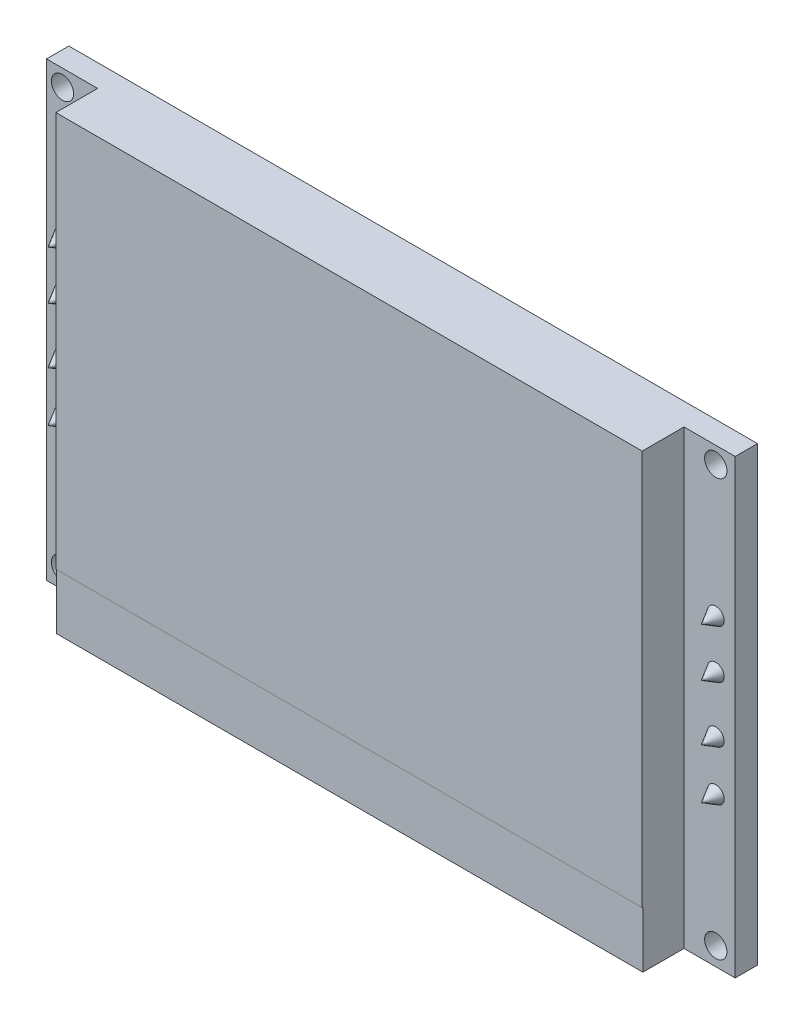
ISO-10303-21;
HEADER;
FILE_DESCRIPTION(('STEP AP214'),'2;1');
FILE_NAME('part.step','',(''),(''),'','','');
FILE_SCHEMA(('AUTOMOTIVE_DESIGN { 1 0 10303 214 1 1 1 1 }'));
ENDSEC;
DATA;
#1=APPLICATION_CONTEXT('core data for automotive mechanical design processes');
#2=APPLICATION_PROTOCOL_DEFINITION('international standard','automotive_design',2000,#1);
#3=PRODUCT_CONTEXT('',#1,'mechanical');
#4=PRODUCT('Part','Part','',(#3));
#5=PRODUCT_RELATED_PRODUCT_CATEGORY('part','',(#4));
#6=PRODUCT_DEFINITION_FORMATION('','',#4);
#7=PRODUCT_DEFINITION_CONTEXT('part definition',#1,'design');
#8=PRODUCT_DEFINITION('design','',#6,#7);
#9=PRODUCT_DEFINITION_SHAPE('','',#8);
#10=(LENGTH_UNIT() NAMED_UNIT(*) SI_UNIT(.MILLI.,.METRE.));
#11=(NAMED_UNIT(*) PLANE_ANGLE_UNIT() SI_UNIT($,.RADIAN.));
#12=(NAMED_UNIT(*) SI_UNIT($,.STERADIAN.) SOLID_ANGLE_UNIT());
#13=UNCERTAINTY_MEASURE_WITH_UNIT(LENGTH_MEASURE(1.E-05),#10,'distance_accuracy_value','');
#14=(GEOMETRIC_REPRESENTATION_CONTEXT(3) GLOBAL_UNCERTAINTY_ASSIGNED_CONTEXT((#13)) GLOBAL_UNIT_ASSIGNED_CONTEXT((#10,
#11,#12)) REPRESENTATION_CONTEXT('',''));
#15=CARTESIAN_POINT('',(0.,0.,0.));
#16=DIRECTION('',(0.,0.,1.));
#17=DIRECTION('',(1.,0.,0.));
#18=AXIS2_PLACEMENT_3D('',#15,#16,#17);
#19=CARTESIAN_POINT('',(0.,0.,1.6));
#20=DIRECTION('',(0.,0.,-1.));
#21=DIRECTION('',(-1.,0.,0.));
#22=AXIS2_PLACEMENT_3D('',#19,#20,#21);
#23=PLANE('',#22);
#24=CARTESIAN_POINT('',(48.0081893313298,18.3157101577395,1.6));
#25=DIRECTION('',(0.,0.,-1.));
#26=DIRECTION('',(-1.,0.,0.));
#27=AXIS2_PLACEMENT_3D('',#24,#25,#26);
#28=CIRCLE('',#27,0.6);
#29=CARTESIAN_POINT('',(47.4081893313298,18.3157101577395,1.6));
#30=VERTEX_POINT('',#29);
#31=EDGE_CURVE('E41',#30,#30,#28,.F.);
#32=ORIENTED_EDGE('',*,*,#31,.F.);
#33=EDGE_LOOP('',(#32));
#34=FACE_BOUND('',#33,.T.);
#35=CARTESIAN_POINT('',(48.0081893313298,21.8037691178312,1.6));
#36=DIRECTION('',(0.,0.,-1.));
#37=DIRECTION('',(-1.,0.,0.));
#38=AXIS2_PLACEMENT_3D('',#35,#36,#37);
#39=CIRCLE('',#38,0.6);
#40=CARTESIAN_POINT('',(47.4081893313298,21.8037691178312,1.6));
#41=VERTEX_POINT('',#40);
#42=EDGE_CURVE('E340',#41,#41,#39,.F.);
#43=ORIENTED_EDGE('',*,*,#42,.F.);
#44=EDGE_LOOP('',(#43));
#45=FACE_BOUND('',#44,.T.);
#46=CARTESIAN_POINT('',(48.0081893313298,31.2037691178312,1.6));
#47=DIRECTION('',(0.,0.,1.));
#48=DIRECTION('',(1.,0.,0.));
#49=AXIS2_PLACEMENT_3D('',#46,#47,#48);
#50=CIRCLE('',#49,0.800000000000002);
#51=CARTESIAN_POINT('',(48.8081893313298,31.2037691178312,1.6));
#52=VERTEX_POINT('',#51);
#53=EDGE_CURVE('E255',#52,#52,#50,.T.);
#54=ORIENTED_EDGE('',*,*,#53,.F.);
#55=EDGE_LOOP('',(#54));
#56=FACE_BOUND('',#55,.T.);
#57=CARTESIAN_POINT('',(48.0081893313298,1.31386177998997,1.6));
#58=DIRECTION('',(0.,0.,1.));
#59=DIRECTION('',(1.,0.,0.));
#60=AXIS2_PLACEMENT_3D('',#57,#58,#59);
#61=CIRCLE('',#60,0.800000000000003);
#62=CARTESIAN_POINT('',(48.8081893313298,1.31386177998997,1.6));
#63=VERTEX_POINT('',#62);
#64=EDGE_CURVE('E251',#63,#63,#61,.T.);
#65=ORIENTED_EDGE('',*,*,#64,.F.);
#66=EDGE_LOOP('',(#65));
#67=FACE_BOUND('',#66,.T.);
#68=DIRECTION('',(0.,1.,0.));
#69=VECTOR('',#68,1.);
#70=CARTESIAN_POINT('',(45.73,32.4,1.6));
#71=LINE('',#70,#69);
#72=CARTESIAN_POINT('',(45.73,0.,1.6));
#73=VERTEX_POINT('',#72);
#74=CARTESIAN_POINT('',(45.73,32.4,1.6));
#75=VERTEX_POINT('',#74);
#76=EDGE_CURVE('E209',#73,#75,#71,.T.);
#77=ORIENTED_EDGE('',*,*,#76,.F.);
#78=DIRECTION('',(1.,0.,0.));
#79=VECTOR('',#78,1.);
#80=CARTESIAN_POINT('',(0.,0.,1.6));
#81=LINE('',#80,#79);
#82=CARTESIAN_POINT('',(49.4,0.,1.6));
#83=VERTEX_POINT('',#82);
#84=EDGE_CURVE('E362',#73,#83,#81,.T.);
#85=ORIENTED_EDGE('',*,*,#84,.T.);
#86=DIRECTION('',(0.,1.,0.));
#87=VECTOR('',#86,1.);
#88=CARTESIAN_POINT('',(49.4,0.,1.6));
#89=LINE('',#88,#87);
#90=CARTESIAN_POINT('',(49.4,32.4,1.6));
#91=VERTEX_POINT('',#90);
#92=EDGE_CURVE('E361',#83,#91,#89,.T.);
#93=ORIENTED_EDGE('',*,*,#92,.T.);
#94=DIRECTION('',(-1.,0.,0.));
#95=VECTOR('',#94,1.);
#96=CARTESIAN_POINT('',(0.,32.4,1.6));
#97=LINE('',#96,#95);
#98=EDGE_CURVE('E369',#91,#75,#97,.T.);
#99=ORIENTED_EDGE('',*,*,#98,.T.);
#100=EDGE_LOOP('',(#77,#85,#93,#99));
#101=FACE_BOUND('',#100,.T.);
#102=CARTESIAN_POINT('',(48.0081893313298,10.71386177999,1.6));
#103=DIRECTION('',(0.,0.,-1.));
#104=DIRECTION('',(-1.,0.,0.));
#105=AXIS2_PLACEMENT_3D('',#102,#103,#104);
#106=CIRCLE('',#105,0.600000000000001);
#107=CARTESIAN_POINT('',(47.4081893313298,10.71386177999,1.6));
#108=VERTEX_POINT('',#107);
#109=EDGE_CURVE('E337',#108,#108,#106,.F.);
#110=ORIENTED_EDGE('',*,*,#109,.F.);
#111=EDGE_LOOP('',(#110));
#112=FACE_BOUND('',#111,.T.);
#113=CARTESIAN_POINT('',(48.0081893313298,14.3059190077634,1.6));
#114=DIRECTION('',(0.,0.,-1.));
#115=DIRECTION('',(-1.,0.,0.));
#116=AXIS2_PLACEMENT_3D('',#113,#114,#115);
#117=CIRCLE('',#116,0.600000000000001);
#118=CARTESIAN_POINT('',(47.4081893313298,14.3059190077634,1.6));
#119=VERTEX_POINT('',#118);
#120=EDGE_CURVE('E11',#119,#119,#117,.F.);
#121=ORIENTED_EDGE('',*,*,#120,.F.);
#122=EDGE_LOOP('',(#121));
#123=FACE_BOUND('',#122,.T.);
#124=ADVANCED_FACE('F33',(#34,#45,#56,#67,#101,#112,#123),#23,.F.);
#125=CARTESIAN_POINT('',(1.14437766090657,18.3157101577395,1.6));
#126=DIRECTION('',(0.,0.,-1.));
#127=DIRECTION('',(-1.,0.,0.));
#128=AXIS2_PLACEMENT_3D('',#125,#126,#127);
#129=CIRCLE('',#128,0.6);
#130=CARTESIAN_POINT('',(0.544377660906566,18.3157101577395,1.6));
#131=VERTEX_POINT('',#130);
#132=EDGE_CURVE('E332',#131,#131,#129,.F.);
#133=ORIENTED_EDGE('',*,*,#132,.F.);
#134=EDGE_LOOP('',(#133));
#135=FACE_BOUND('',#134,.T.);
#136=CARTESIAN_POINT('',(1.14437766090657,21.8037691178312,1.6));
#137=DIRECTION('',(0.,0.,-1.));
#138=DIRECTION('',(-1.,0.,0.));
#139=AXIS2_PLACEMENT_3D('',#136,#137,#138);
#140=CIRCLE('',#139,0.6);
#141=CARTESIAN_POINT('',(0.544377660906565,21.8037691178312,1.6));
#142=VERTEX_POINT('',#141);
#143=EDGE_CURVE('E201',#142,#142,#140,.F.);
#144=ORIENTED_EDGE('',*,*,#143,.F.);
#145=EDGE_LOOP('',(#144));
#146=FACE_BOUND('',#145,.T.);
#147=CARTESIAN_POINT('',(1.14437766090656,1.31386177998997,1.6));
#148=DIRECTION('',(0.,0.,1.));
#149=DIRECTION('',(1.,0.,0.));
#150=AXIS2_PLACEMENT_3D('',#147,#148,#149);
#151=CIRCLE('',#150,0.8);
#152=CARTESIAN_POINT('',(1.94437766090656,1.31386177998997,1.6));
#153=VERTEX_POINT('',#152);
#154=EDGE_CURVE('E247',#153,#153,#151,.T.);
#155=ORIENTED_EDGE('',*,*,#154,.F.);
#156=EDGE_LOOP('',(#155));
#157=FACE_BOUND('',#156,.T.);
#158=CARTESIAN_POINT('',(1.14437766090656,31.2037691178312,1.6));
#159=DIRECTION('',(0.,0.,1.));
#160=DIRECTION('',(1.,0.,0.));
#161=AXIS2_PLACEMENT_3D('',#158,#159,#160);
#162=CIRCLE('',#161,0.8);
#163=CARTESIAN_POINT('',(1.94437766090656,31.2037691178312,1.6));
#164=VERTEX_POINT('',#163);
#165=EDGE_CURVE('E243',#164,#164,#162,.T.);
#166=ORIENTED_EDGE('',*,*,#165,.F.);
#167=EDGE_LOOP('',(#166));
#168=FACE_BOUND('',#167,.T.);
#169=DIRECTION('',(0.,-1.,0.));
#170=VECTOR('',#169,1.);
#171=CARTESIAN_POINT('',(3.66999999999999,32.4,1.6));
#172=LINE('',#171,#170);
#173=CARTESIAN_POINT('',(3.66999999999999,32.4,1.6));
#174=VERTEX_POINT('',#173);
#175=CARTESIAN_POINT('',(3.66999999999999,0.,1.6));
#176=VERTEX_POINT('',#175);
#177=EDGE_CURVE('E56',#174,#176,#172,.T.);
#178=ORIENTED_EDGE('',*,*,#177,.F.);
#179=CARTESIAN_POINT('',(0.,32.4,1.6));
#180=VERTEX_POINT('',#179);
#181=EDGE_CURVE('E227',#174,#180,#97,.T.);
#182=ORIENTED_EDGE('',*,*,#181,.T.);
#183=DIRECTION('',(0.,-1.,0.));
#184=VECTOR('',#183,1.);
#185=CARTESIAN_POINT('',(0.,0.,1.6));
#186=LINE('',#185,#184);
#187=CARTESIAN_POINT('',(0.,0.,1.6));
#188=VERTEX_POINT('',#187);
#189=EDGE_CURVE('E220',#180,#188,#186,.T.);
#190=ORIENTED_EDGE('',*,*,#189,.T.);
#191=EDGE_CURVE('E359',#188,#176,#81,.T.);
#192=ORIENTED_EDGE('',*,*,#191,.T.);
#193=EDGE_LOOP('',(#178,#182,#190,#192));
#194=FACE_BOUND('',#193,.T.);
#195=CARTESIAN_POINT('',(1.14437766090657,10.71386177999,1.6));
#196=DIRECTION('',(0.,0.,-1.));
#197=DIRECTION('',(-1.,0.,0.));
#198=AXIS2_PLACEMENT_3D('',#195,#196,#197);
#199=CIRCLE('',#198,0.6);
#200=CARTESIAN_POINT('',(0.544377660906568,10.71386177999,1.6));
#201=VERTEX_POINT('',#200);
#202=EDGE_CURVE('E342',#201,#201,#199,.F.);
#203=ORIENTED_EDGE('',*,*,#202,.F.);
#204=EDGE_LOOP('',(#203));
#205=FACE_BOUND('',#204,.T.);
#206=CARTESIAN_POINT('',(1.14437766090657,14.3059190077634,1.6));
#207=DIRECTION('',(0.,0.,-1.));
#208=DIRECTION('',(-1.,0.,0.));
#209=AXIS2_PLACEMENT_3D('',#206,#207,#208);
#210=CIRCLE('',#209,0.6);
#211=CARTESIAN_POINT('',(0.544377660906567,14.3059190077634,1.6));
#212=VERTEX_POINT('',#211);
#213=EDGE_CURVE('E330',#212,#212,#210,.F.);
#214=ORIENTED_EDGE('',*,*,#213,.F.);
#215=EDGE_LOOP('',(#214));
#216=FACE_BOUND('',#215,.T.);
#217=ADVANCED_FACE('F142',(#135,#146,#157,#168,#194,#205,#216),#23,.F.);
#218=CARTESIAN_POINT('',(0.,0.,1.6));
#219=DIRECTION('',(0.,1.,0.));
#220=DIRECTION('',(0.,0.,1.));
#221=AXIS2_PLACEMENT_3D('',#218,#219,#220);
#222=PLANE('',#221);
#223=DIRECTION('',(1.,0.,0.));
#224=VECTOR('',#223,1.);
#225=CARTESIAN_POINT('',(3.66999999999999,0.,4.55));
#226=LINE('',#225,#224);
#227=CARTESIAN_POINT('',(3.66999999999999,0.,4.55));
#228=VERTEX_POINT('',#227);
#229=CARTESIAN_POINT('',(45.73,0.,4.55));
#230=VERTEX_POINT('',#229);
#231=EDGE_CURVE('E176',#228,#230,#226,.T.);
#232=ORIENTED_EDGE('',*,*,#231,.F.);
#233=DIRECTION('',(0.,0.,-1.));
#234=VECTOR('',#233,1.);
#235=CARTESIAN_POINT('',(3.66999999999999,0.,4.6));
#236=LINE('',#235,#234);
#237=EDGE_CURVE('E178',#228,#176,#236,.T.);
#238=ORIENTED_EDGE('',*,*,#237,.T.);
#239=ORIENTED_EDGE('',*,*,#191,.F.);
#240=DIRECTION('',(0.,0.,-1.));
#241=VECTOR('',#240,1.);
#242=CARTESIAN_POINT('',(0.,0.,1.6));
#243=LINE('',#242,#241);
#244=CARTESIAN_POINT('',(0.,0.,0.));
#245=VERTEX_POINT('',#244);
#246=EDGE_CURVE('E347',#188,#245,#243,.T.);
#247=ORIENTED_EDGE('',*,*,#246,.T.);
#248=DIRECTION('',(1.,0.,0.));
#249=VECTOR('',#248,1.);
#250=CARTESIAN_POINT('',(0.,0.,0.));
#251=LINE('',#250,#249);
#252=CARTESIAN_POINT('',(49.4,0.,0.));
#253=VERTEX_POINT('',#252);
#254=EDGE_CURVE('E193',#245,#253,#251,.T.);
#255=ORIENTED_EDGE('',*,*,#254,.T.);
#256=DIRECTION('',(0.,0.,-1.));
#257=VECTOR('',#256,1.);
#258=CARTESIAN_POINT('',(49.4,0.,1.6));
#259=LINE('',#258,#257);
#260=EDGE_CURVE('E351',#83,#253,#259,.T.);
#261=ORIENTED_EDGE('',*,*,#260,.F.);
#262=ORIENTED_EDGE('',*,*,#84,.F.);
#263=DIRECTION('',(0.,0.,-1.));
#264=VECTOR('',#263,1.);
#265=CARTESIAN_POINT('',(45.73,0.,4.6));
#266=LINE('',#265,#264);
#267=EDGE_CURVE('E180',#230,#73,#266,.T.);
#268=ORIENTED_EDGE('',*,*,#267,.F.);
#269=EDGE_LOOP('',(#232,#238,#239,#247,#255,#261,#262,#268));
#270=FACE_BOUND('',#269,.T.);
#271=ADVANCED_FACE('F149',(#270),#222,.F.);
#272=CARTESIAN_POINT('',(0.,0.,1.6));
#273=DIRECTION('',(1.,0.,0.));
#274=DIRECTION('',(0.,1.,0.));
#275=AXIS2_PLACEMENT_3D('',#272,#273,#274);
#276=PLANE('',#275);
#277=DIRECTION('',(0.,-1.,0.));
#278=VECTOR('',#277,1.);
#279=CARTESIAN_POINT('',(0.,0.,0.));
#280=LINE('',#279,#278);
#281=CARTESIAN_POINT('',(0.,32.4,0.));
#282=VERTEX_POINT('',#281);
#283=EDGE_CURVE('E190',#282,#245,#280,.T.);
#284=ORIENTED_EDGE('',*,*,#283,.T.);
#285=ORIENTED_EDGE('',*,*,#246,.F.);
#286=ORIENTED_EDGE('',*,*,#189,.F.);
#287=DIRECTION('',(0.,0.,-1.));
#288=VECTOR('',#287,1.);
#289=CARTESIAN_POINT('',(0.,32.4,1.6));
#290=LINE('',#289,#288);
#291=EDGE_CURVE('E370',#180,#282,#290,.T.);
#292=ORIENTED_EDGE('',*,*,#291,.T.);
#293=EDGE_LOOP('',(#284,#285,#286,#292));
#294=FACE_BOUND('',#293,.T.);
#295=ADVANCED_FACE('F35',(#294),#276,.F.);
#296=CARTESIAN_POINT('',(49.4,0.,1.6));
#297=DIRECTION('',(-1.,0.,0.));
#298=DIRECTION('',(0.,-1.,0.));
#299=AXIS2_PLACEMENT_3D('',#296,#297,#298);
#300=PLANE('',#299);
#301=DIRECTION('',(0.,1.,0.));
#302=VECTOR('',#301,1.);
#303=CARTESIAN_POINT('',(49.4,0.,0.));
#304=LINE('',#303,#302);
#305=CARTESIAN_POINT('',(49.4,32.4,0.));
#306=VERTEX_POINT('',#305);
#307=EDGE_CURVE('E381',#253,#306,#304,.T.);
#308=ORIENTED_EDGE('',*,*,#307,.T.);
#309=DIRECTION('',(0.,0.,-1.));
#310=VECTOR('',#309,1.);
#311=CARTESIAN_POINT('',(49.4,32.4,1.6));
#312=LINE('',#311,#310);
#313=EDGE_CURVE('E355',#91,#306,#312,.T.);
#314=ORIENTED_EDGE('',*,*,#313,.F.);
#315=ORIENTED_EDGE('',*,*,#92,.F.);
#316=ORIENTED_EDGE('',*,*,#260,.T.);
#317=EDGE_LOOP('',(#308,#314,#315,#316));
#318=FACE_BOUND('',#317,.T.);
#319=ADVANCED_FACE('F164',(#318),#300,.F.);
#320=CARTESIAN_POINT('',(0.,32.4,1.6));
#321=DIRECTION('',(0.,-1.,0.));
#322=DIRECTION('',(0.,0.,-1.));
#323=AXIS2_PLACEMENT_3D('',#320,#321,#322);
#324=PLANE('',#323);
#325=DIRECTION('',(-1.,0.,0.));
#326=VECTOR('',#325,1.);
#327=CARTESIAN_POINT('',(0.,32.4,0.));
#328=LINE('',#327,#326);
#329=EDGE_CURVE('E379',#306,#282,#328,.T.);
#330=ORIENTED_EDGE('',*,*,#329,.T.);
#331=ORIENTED_EDGE('',*,*,#291,.F.);
#332=ORIENTED_EDGE('',*,*,#181,.F.);
#333=DIRECTION('',(0.,0.,-1.));
#334=VECTOR('',#333,1.);
#335=CARTESIAN_POINT('',(3.66999999999999,32.4,4.6));
#336=LINE('',#335,#334);
#337=CARTESIAN_POINT('',(3.66999999999999,32.4,4.6));
#338=VERTEX_POINT('',#337);
#339=EDGE_CURVE('E211',#338,#174,#336,.T.);
#340=ORIENTED_EDGE('',*,*,#339,.F.);
#341=DIRECTION('',(-1.,0.,0.));
#342=VECTOR('',#341,1.);
#343=CARTESIAN_POINT('',(3.66999999999999,32.4,4.6));
#344=LINE('',#343,#342);
#345=CARTESIAN_POINT('',(45.73,32.4,4.6));
#346=VERTEX_POINT('',#345);
#347=EDGE_CURVE('E216',#346,#338,#344,.T.);
#348=ORIENTED_EDGE('',*,*,#347,.F.);
#349=DIRECTION('',(0.,0.,-1.));
#350=VECTOR('',#349,1.);
#351=CARTESIAN_POINT('',(45.73,32.4,4.6));
#352=LINE('',#351,#350);
#353=EDGE_CURVE('E195',#346,#75,#352,.T.);
#354=ORIENTED_EDGE('',*,*,#353,.T.);
#355=ORIENTED_EDGE('',*,*,#98,.F.);
#356=ORIENTED_EDGE('',*,*,#313,.T.);
#357=EDGE_LOOP('',(#330,#331,#332,#340,#348,#354,#355,#356));
#358=FACE_BOUND('',#357,.T.);
#359=ADVANCED_FACE('F160',(#358),#324,.F.);
#360=CARTESIAN_POINT('',(0.,0.,0.));
#361=DIRECTION('',(0.,0.,-1.));
#362=DIRECTION('',(-1.,0.,0.));
#363=AXIS2_PLACEMENT_3D('',#360,#361,#362);
#364=PLANE('',#363);
#365=CARTESIAN_POINT('',(48.0081893313298,31.2037691178312,0.));
#366=DIRECTION('',(0.,0.,-1.));
#367=DIRECTION('',(-1.,0.,0.));
#368=AXIS2_PLACEMENT_3D('',#365,#366,#367);
#369=CIRCLE('',#368,0.800000000000002);
#370=CARTESIAN_POINT('',(47.2081893313298,31.2037691178312,0.));
#371=VERTEX_POINT('',#370);
#372=EDGE_CURVE('E254',#371,#371,#369,.T.);
#373=ORIENTED_EDGE('',*,*,#372,.F.);
#374=EDGE_LOOP('',(#373));
#375=FACE_BOUND('',#374,.T.);
#376=CARTESIAN_POINT('',(48.0081893313298,1.31386177998997,0.));
#377=DIRECTION('',(0.,0.,-1.));
#378=DIRECTION('',(-1.,0.,0.));
#379=AXIS2_PLACEMENT_3D('',#376,#377,#378);
#380=CIRCLE('',#379,0.800000000000003);
#381=CARTESIAN_POINT('',(47.2081893313298,1.31386177998997,0.));
#382=VERTEX_POINT('',#381);
#383=EDGE_CURVE('E250',#382,#382,#380,.T.);
#384=ORIENTED_EDGE('',*,*,#383,.F.);
#385=EDGE_LOOP('',(#384));
#386=FACE_BOUND('',#385,.T.);
#387=CARTESIAN_POINT('',(1.14437766090656,1.31386177998997,0.));
#388=DIRECTION('',(0.,0.,-1.));
#389=DIRECTION('',(-1.,0.,0.));
#390=AXIS2_PLACEMENT_3D('',#387,#388,#389);
#391=CIRCLE('',#390,0.8);
#392=CARTESIAN_POINT('',(0.344377660906564,1.31386177998997,0.));
#393=VERTEX_POINT('',#392);
#394=EDGE_CURVE('E246',#393,#393,#391,.T.);
#395=ORIENTED_EDGE('',*,*,#394,.F.);
#396=EDGE_LOOP('',(#395));
#397=FACE_BOUND('',#396,.T.);
#398=CARTESIAN_POINT('',(1.14437766090656,31.2037691178312,0.));
#399=DIRECTION('',(0.,0.,-1.));
#400=DIRECTION('',(-1.,0.,0.));
#401=AXIS2_PLACEMENT_3D('',#398,#399,#400);
#402=CIRCLE('',#401,0.8);
#403=CARTESIAN_POINT('',(0.344377660906564,31.2037691178312,0.));
#404=VERTEX_POINT('',#403);
#405=EDGE_CURVE('E210',#404,#404,#402,.T.);
#406=ORIENTED_EDGE('',*,*,#405,.F.);
#407=EDGE_LOOP('',(#406));
#408=FACE_BOUND('',#407,.T.);
#409=ORIENTED_EDGE('',*,*,#283,.F.);
#410=ORIENTED_EDGE('',*,*,#329,.F.);
#411=ORIENTED_EDGE('',*,*,#307,.F.);
#412=ORIENTED_EDGE('',*,*,#254,.F.);
#413=EDGE_LOOP('',(#409,#410,#411,#412));
#414=FACE_BOUND('',#413,.T.);
#415=ADVANCED_FACE('F157',(#375,#386,#397,#408,#414),#364,.T.);
#416=CARTESIAN_POINT('',(3.66999999999999,32.4,4.6));
#417=DIRECTION('',(1.,0.,0.));
#418=DIRECTION('',(0.,0.,-1.));
#419=AXIS2_PLACEMENT_3D('',#416,#417,#418);
#420=PLANE('',#419);
#421=DIRECTION('',(0.,-1.,0.));
#422=VECTOR('',#421,1.);
#423=CARTESIAN_POINT('',(3.66999999999999,4.03562486538943,4.55));
#424=LINE('',#423,#422);
#425=CARTESIAN_POINT('',(3.66999999999999,4.03562486538943,4.55));
#426=VERTEX_POINT('',#425);
#427=EDGE_CURVE('E184',#426,#228,#424,.T.);
#428=ORIENTED_EDGE('',*,*,#427,.F.);
#429=DIRECTION('',(0.,0.,1.));
#430=VECTOR('',#429,1.);
#431=CARTESIAN_POINT('',(3.66999999999999,4.03562486538943,4.55));
#432=LINE('',#431,#430);
#433=CARTESIAN_POINT('',(3.66999999999999,4.03562486538943,4.6));
#434=VERTEX_POINT('',#433);
#435=EDGE_CURVE('E258',#426,#434,#432,.T.);
#436=ORIENTED_EDGE('',*,*,#435,.T.);
#437=DIRECTION('',(0.,-1.,0.));
#438=VECTOR('',#437,1.);
#439=CARTESIAN_POINT('',(3.66999999999999,32.4,4.6));
#440=LINE('',#439,#438);
#441=EDGE_CURVE('E226',#338,#434,#440,.T.);
#442=ORIENTED_EDGE('',*,*,#441,.F.);
#443=ORIENTED_EDGE('',*,*,#339,.T.);
#444=ORIENTED_EDGE('',*,*,#177,.T.);
#445=ORIENTED_EDGE('',*,*,#237,.F.);
#446=EDGE_LOOP('',(#428,#436,#442,#443,#444,#445));
#447=FACE_BOUND('',#446,.T.);
#448=ADVANCED_FACE('F155',(#447),#420,.F.);
#449=CARTESIAN_POINT('',(45.73,32.4,4.6));
#450=DIRECTION('',(-1.,0.,0.));
#451=DIRECTION('',(0.,0.,1.));
#452=AXIS2_PLACEMENT_3D('',#449,#450,#451);
#453=PLANE('',#452);
#454=DIRECTION('',(0.,1.,0.));
#455=VECTOR('',#454,1.);
#456=CARTESIAN_POINT('',(45.73,32.4,4.6));
#457=LINE('',#456,#455);
#458=CARTESIAN_POINT('',(45.73,4.03562486538943,4.6));
#459=VERTEX_POINT('',#458);
#460=EDGE_CURVE('E237',#459,#346,#457,.T.);
#461=ORIENTED_EDGE('',*,*,#460,.F.);
#462=DIRECTION('',(0.,0.,1.));
#463=VECTOR('',#462,1.);
#464=CARTESIAN_POINT('',(45.73,4.03562486538943,4.55));
#465=LINE('',#464,#463);
#466=CARTESIAN_POINT('',(45.73,4.03562486538943,4.55));
#467=VERTEX_POINT('',#466);
#468=EDGE_CURVE('E48',#467,#459,#465,.T.);
#469=ORIENTED_EDGE('',*,*,#468,.F.);
#470=DIRECTION('',(0.,1.,0.));
#471=VECTOR('',#470,1.);
#472=CARTESIAN_POINT('',(45.73,4.03562486538943,4.55));
#473=LINE('',#472,#471);
#474=EDGE_CURVE('E183',#230,#467,#473,.T.);
#475=ORIENTED_EDGE('',*,*,#474,.F.);
#476=ORIENTED_EDGE('',*,*,#267,.T.);
#477=ORIENTED_EDGE('',*,*,#76,.T.);
#478=ORIENTED_EDGE('',*,*,#353,.F.);
#479=EDGE_LOOP('',(#461,#469,#475,#476,#477,#478));
#480=FACE_BOUND('',#479,.T.);
#481=ADVANCED_FACE('F270',(#480),#453,.F.);
#482=CARTESIAN_POINT('',(0.,0.,4.6));
#483=DIRECTION('',(0.,0.,1.));
#484=DIRECTION('',(1.,0.,0.));
#485=AXIS2_PLACEMENT_3D('',#482,#483,#484);
#486=PLANE('',#485);
#487=DIRECTION('',(-1.,0.,0.));
#488=VECTOR('',#487,1.);
#489=CARTESIAN_POINT('',(3.66999999999999,4.03562486538943,4.6));
#490=LINE('',#489,#488);
#491=EDGE_CURVE('E262',#459,#434,#490,.T.);
#492=ORIENTED_EDGE('',*,*,#491,.F.);
#493=ORIENTED_EDGE('',*,*,#460,.T.);
#494=ORIENTED_EDGE('',*,*,#347,.T.);
#495=ORIENTED_EDGE('',*,*,#441,.T.);
#496=EDGE_LOOP('',(#492,#493,#494,#495));
#497=FACE_BOUND('',#496,.T.);
#498=ADVANCED_FACE('F273',(#497),#486,.T.);
#499=CARTESIAN_POINT('',(1.14437766090656,31.2037691178312,-1.4));
#500=DIRECTION('',(0.,0.,1.));
#501=DIRECTION('',(1.,0.,0.));
#502=AXIS2_PLACEMENT_3D('',#499,#500,#501);
#503=CYLINDRICAL_SURFACE('',#502,0.8);
#504=ORIENTED_EDGE('',*,*,#405,.T.);
#505=EDGE_LOOP('',(#504));
#506=FACE_BOUND('',#505,.T.);
#507=ORIENTED_EDGE('',*,*,#165,.T.);
#508=EDGE_LOOP('',(#507));
#509=FACE_BOUND('',#508,.T.);
#510=ADVANCED_FACE('F275',(#506,#509),#503,.F.);
#511=CARTESIAN_POINT('',(1.14437766090656,1.31386177998997,-1.4));
#512=DIRECTION('',(0.,0.,1.));
#513=DIRECTION('',(1.,0.,0.));
#514=AXIS2_PLACEMENT_3D('',#511,#512,#513);
#515=CYLINDRICAL_SURFACE('',#514,0.8);
#516=ORIENTED_EDGE('',*,*,#394,.T.);
#517=EDGE_LOOP('',(#516));
#518=FACE_BOUND('',#517,.T.);
#519=ORIENTED_EDGE('',*,*,#154,.T.);
#520=EDGE_LOOP('',(#519));
#521=FACE_BOUND('',#520,.T.);
#522=ADVANCED_FACE('F281',(#518,#521),#515,.F.);
#523=CARTESIAN_POINT('',(48.0081893313298,1.31386177998997,-1.4));
#524=DIRECTION('',(0.,0.,1.));
#525=DIRECTION('',(1.,0.,0.));
#526=AXIS2_PLACEMENT_3D('',#523,#524,#525);
#527=CYLINDRICAL_SURFACE('',#526,0.800000000000003);
#528=ORIENTED_EDGE('',*,*,#383,.T.);
#529=EDGE_LOOP('',(#528));
#530=FACE_BOUND('',#529,.T.);
#531=ORIENTED_EDGE('',*,*,#64,.T.);
#532=EDGE_LOOP('',(#531));
#533=FACE_BOUND('',#532,.T.);
#534=ADVANCED_FACE('F287',(#530,#533),#527,.F.);
#535=CARTESIAN_POINT('',(48.0081893313298,31.2037691178312,-1.4));
#536=DIRECTION('',(0.,0.,1.));
#537=DIRECTION('',(1.,0.,0.));
#538=AXIS2_PLACEMENT_3D('',#535,#536,#537);
#539=CYLINDRICAL_SURFACE('',#538,0.800000000000002);
#540=ORIENTED_EDGE('',*,*,#372,.T.);
#541=EDGE_LOOP('',(#540));
#542=FACE_BOUND('',#541,.T.);
#543=ORIENTED_EDGE('',*,*,#53,.T.);
#544=EDGE_LOOP('',(#543));
#545=FACE_BOUND('',#544,.T.);
#546=ADVANCED_FACE('F291',(#542,#545),#539,.F.);
#547=CARTESIAN_POINT('',(3.66999999999999,4.03562486538943,4.55));
#548=DIRECTION('',(0.,1.,0.));
#549=DIRECTION('',(0.,0.,1.));
#550=AXIS2_PLACEMENT_3D('',#547,#548,#549);
#551=PLANE('',#550);
#552=ORIENTED_EDGE('',*,*,#491,.T.);
#553=ORIENTED_EDGE('',*,*,#435,.F.);
#554=DIRECTION('',(-1.,0.,0.));
#555=VECTOR('',#554,1.);
#556=CARTESIAN_POINT('',(3.66999999999999,4.03562486538943,4.55));
#557=LINE('',#556,#555);
#558=EDGE_CURVE('E260',#467,#426,#557,.T.);
#559=ORIENTED_EDGE('',*,*,#558,.F.);
#560=ORIENTED_EDGE('',*,*,#468,.T.);
#561=EDGE_LOOP('',(#552,#553,#559,#560));
#562=FACE_BOUND('',#561,.T.);
#563=ADVANCED_FACE('F268',(#562),#551,.F.);
#564=CARTESIAN_POINT('',(0.,0.,4.55));
#565=DIRECTION('',(0.,0.,1.));
#566=DIRECTION('',(1.,0.,0.));
#567=AXIS2_PLACEMENT_3D('',#564,#565,#566);
#568=PLANE('',#567);
#569=ORIENTED_EDGE('',*,*,#427,.T.);
#570=ORIENTED_EDGE('',*,*,#231,.T.);
#571=ORIENTED_EDGE('',*,*,#474,.T.);
#572=ORIENTED_EDGE('',*,*,#558,.T.);
#573=EDGE_LOOP('',(#569,#570,#571,#572));
#574=FACE_BOUND('',#573,.T.);
#575=ADVANCED_FACE('F267',(#574),#568,.T.);
#576=CARTESIAN_POINT('',(1.14437766090657,21.8037691178312,1.6));
#577=DIRECTION('',(0.,0.,-1.));
#578=DIRECTION('',(1.,0.,0.));
#579=AXIS2_PLACEMENT_3D('',#576,#577,#578);
#580=CONICAL_SURFACE('',#579,0.6,0.5235987755983);
#581=CARTESIAN_POINT('',(1.14437766090657,21.8037691178312,2.63923048454132));
#582=VERTEX_POINT('',#581);
#583=VERTEX_LOOP('',#582);
#584=FACE_BOUND('',#583,.T.);
#585=ORIENTED_EDGE('',*,*,#143,.T.);
#586=EDGE_LOOP('',(#585));
#587=FACE_BOUND('',#586,.T.);
#588=ADVANCED_FACE('F300',(#584,#587),#580,.T.);
#589=CARTESIAN_POINT('',(1.14437766090657,10.71386177999,1.6));
#590=DIRECTION('',(0.,0.,-1.));
#591=DIRECTION('',(1.,0.,0.));
#592=AXIS2_PLACEMENT_3D('',#589,#590,#591);
#593=CONICAL_SURFACE('',#592,0.6,0.5235987755983);
#594=CARTESIAN_POINT('',(1.14437766090657,10.71386177999,2.63923048454132));
#595=VERTEX_POINT('',#594);
#596=VERTEX_LOOP('',#595);
#597=FACE_BOUND('',#596,.T.);
#598=ORIENTED_EDGE('',*,*,#202,.T.);
#599=EDGE_LOOP('',(#598));
#600=FACE_BOUND('',#599,.T.);
#601=ADVANCED_FACE('F303',(#597,#600),#593,.T.);
#602=CARTESIAN_POINT('',(48.0081893313298,21.8037691178312,1.6));
#603=DIRECTION('',(0.,0.,-1.));
#604=DIRECTION('',(1.,0.,0.));
#605=AXIS2_PLACEMENT_3D('',#602,#603,#604);
#606=CONICAL_SURFACE('',#605,0.6,0.5235987755983);
#607=CARTESIAN_POINT('',(48.0081893313298,21.8037691178312,2.63923048454132));
#608=VERTEX_POINT('',#607);
#609=VERTEX_LOOP('',#608);
#610=FACE_BOUND('',#609,.T.);
#611=ORIENTED_EDGE('',*,*,#42,.T.);
#612=EDGE_LOOP('',(#611));
#613=FACE_BOUND('',#612,.T.);
#614=ADVANCED_FACE('F307',(#610,#613),#606,.T.);
#615=CARTESIAN_POINT('',(48.0081893313298,10.71386177999,1.6));
#616=DIRECTION('',(0.,0.,-1.));
#617=DIRECTION('',(1.,0.,0.));
#618=AXIS2_PLACEMENT_3D('',#615,#616,#617);
#619=CONICAL_SURFACE('',#618,0.600000000000001,0.5235987755983);
#620=CARTESIAN_POINT('',(48.0081893313298,10.71386177999,2.63923048454132));
#621=VERTEX_POINT('',#620);
#622=VERTEX_LOOP('',#621);
#623=FACE_BOUND('',#622,.T.);
#624=ORIENTED_EDGE('',*,*,#109,.T.);
#625=EDGE_LOOP('',(#624));
#626=FACE_BOUND('',#625,.T.);
#627=ADVANCED_FACE('F311',(#623,#626),#619,.T.);
#628=CARTESIAN_POINT('',(1.14437766090657,18.3157101577395,1.6));
#629=DIRECTION('',(0.,0.,-1.));
#630=DIRECTION('',(1.,0.,0.));
#631=AXIS2_PLACEMENT_3D('',#628,#629,#630);
#632=CONICAL_SURFACE('',#631,0.6,0.5235987755983);
#633=CARTESIAN_POINT('',(1.14437766090657,18.3157101577395,2.63923048454132));
#634=VERTEX_POINT('',#633);
#635=VERTEX_LOOP('',#634);
#636=FACE_BOUND('',#635,.T.);
#637=ORIENTED_EDGE('',*,*,#132,.T.);
#638=EDGE_LOOP('',(#637));
#639=FACE_BOUND('',#638,.T.);
#640=ADVANCED_FACE('F315',(#636,#639),#632,.T.);
#641=CARTESIAN_POINT('',(1.14437766090657,14.3059190077634,1.6));
#642=DIRECTION('',(0.,0.,-1.));
#643=DIRECTION('',(1.,0.,0.));
#644=AXIS2_PLACEMENT_3D('',#641,#642,#643);
#645=CONICAL_SURFACE('',#644,0.6,0.5235987755983);
#646=CARTESIAN_POINT('',(1.14437766090657,14.3059190077634,2.63923048454132));
#647=VERTEX_POINT('',#646);
#648=VERTEX_LOOP('',#647);
#649=FACE_BOUND('',#648,.T.);
#650=ORIENTED_EDGE('',*,*,#213,.T.);
#651=EDGE_LOOP('',(#650));
#652=FACE_BOUND('',#651,.T.);
#653=ADVANCED_FACE('F319',(#649,#652),#645,.T.);
#654=CARTESIAN_POINT('',(48.0081893313298,18.3157101577395,1.6));
#655=DIRECTION('',(0.,0.,-1.));
#656=DIRECTION('',(1.,0.,0.));
#657=AXIS2_PLACEMENT_3D('',#654,#655,#656);
#658=CONICAL_SURFACE('',#657,0.6,0.5235987755983);
#659=CARTESIAN_POINT('',(48.0081893313298,18.3157101577395,2.63923048454132));
#660=VERTEX_POINT('',#659);
#661=VERTEX_LOOP('',#660);
#662=FACE_BOUND('',#661,.T.);
#663=ORIENTED_EDGE('',*,*,#31,.T.);
#664=EDGE_LOOP('',(#663));
#665=FACE_BOUND('',#664,.T.);
#666=ADVANCED_FACE('F137',(#662,#665),#658,.T.);
#667=CARTESIAN_POINT('',(48.0081893313298,14.3059190077634,1.6));
#668=DIRECTION('',(0.,0.,-1.));
#669=DIRECTION('',(1.,0.,0.));
#670=AXIS2_PLACEMENT_3D('',#667,#668,#669);
#671=CONICAL_SURFACE('',#670,0.600000000000001,0.5235987755983);
#672=CARTESIAN_POINT('',(48.0081893313298,14.3059190077634,2.63923048454132));
#673=VERTEX_POINT('',#672);
#674=VERTEX_LOOP('',#673);
#675=FACE_BOUND('',#674,.T.);
#676=ORIENTED_EDGE('',*,*,#120,.T.);
#677=EDGE_LOOP('',(#676));
#678=FACE_BOUND('',#677,.T.);
#679=ADVANCED_FACE('F134',(#675,#678),#671,.T.);
#680=CLOSED_SHELL('',(#124,#217,#271,#295,#319,#359,#415,#448,#481,#498,#510,#522,#534,#546,
#563,#575,#588,#601,#614,#627,#640,#653,#666,#679));
#681=MANIFOLD_SOLID_BREP('B2',#680);
#682=ADVANCED_BREP_SHAPE_REPRESENTATION('',(#18,#681),#14);
#683=SHAPE_DEFINITION_REPRESENTATION(#9,#682);
ENDSEC;
END-ISO-10303-21;
